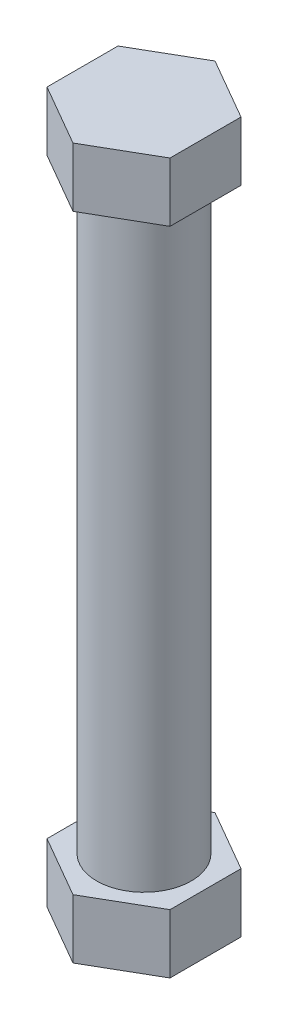
ISO-10303-21;
HEADER;
FILE_DESCRIPTION(('STEP AP214'),'2;1');
FILE_NAME('part.step','',(''),(''),'','','');
FILE_SCHEMA(('AUTOMOTIVE_DESIGN { 1 0 10303 214 1 1 1 1 }'));
ENDSEC;
DATA;
#1=APPLICATION_CONTEXT('core data for automotive mechanical design processes');
#2=APPLICATION_PROTOCOL_DEFINITION('international standard','automotive_design',2000,#1);
#3=PRODUCT_CONTEXT('',#1,'mechanical');
#4=PRODUCT('Part','Part','',(#3));
#5=PRODUCT_RELATED_PRODUCT_CATEGORY('part','',(#4));
#6=PRODUCT_DEFINITION_FORMATION('','',#4);
#7=PRODUCT_DEFINITION_CONTEXT('part definition',#1,'design');
#8=PRODUCT_DEFINITION('design','',#6,#7);
#9=PRODUCT_DEFINITION_SHAPE('','',#8);
#10=(LENGTH_UNIT() NAMED_UNIT(*) SI_UNIT(.MILLI.,.METRE.));
#11=(NAMED_UNIT(*) PLANE_ANGLE_UNIT() SI_UNIT($,.RADIAN.));
#12=(NAMED_UNIT(*) SI_UNIT($,.STERADIAN.) SOLID_ANGLE_UNIT());
#13=UNCERTAINTY_MEASURE_WITH_UNIT(LENGTH_MEASURE(1.E-05),#10,'distance_accuracy_value','');
#14=(GEOMETRIC_REPRESENTATION_CONTEXT(3) GLOBAL_UNCERTAINTY_ASSIGNED_CONTEXT((#13)) GLOBAL_UNIT_ASSIGNED_CONTEXT((#10,
#11,#12)) REPRESENTATION_CONTEXT('',''));
#15=CARTESIAN_POINT('',(0.,0.,0.));
#16=DIRECTION('',(0.,0.,1.));
#17=DIRECTION('',(1.,0.,0.));
#18=AXIS2_PLACEMENT_3D('',#15,#16,#17);
#19=CARTESIAN_POINT('',(0.,127.,0.));
#20=DIRECTION('',(0.,-1.,0.));
#21=DIRECTION('',(0.,0.,-1.));
#22=AXIS2_PLACEMENT_3D('',#19,#20,#21);
#23=CYLINDRICAL_SURFACE('',#22,10.16);
#24=CARTESIAN_POINT('',(0.,127.,0.));
#25=DIRECTION('',(0.,1.,0.));
#26=DIRECTION('',(0.,0.,1.));
#27=AXIS2_PLACEMENT_3D('',#24,#25,#26);
#28=CIRCLE('',#27,10.16);
#29=CARTESIAN_POINT('',(0.,127.,10.16));
#30=VERTEX_POINT('',#29);
#31=EDGE_CURVE('E11',#30,#30,#28,.T.);
#32=ORIENTED_EDGE('',*,*,#31,.F.);
#33=EDGE_LOOP('',(#32));
#34=FACE_BOUND('',#33,.T.);
#35=CARTESIAN_POINT('',(0.,0.,0.));
#36=DIRECTION('',(0.,1.,0.));
#37=DIRECTION('',(0.,0.,1.));
#38=AXIS2_PLACEMENT_3D('',#35,#36,#37);
#39=CIRCLE('',#38,10.16);
#40=CARTESIAN_POINT('',(0.,0.,10.16));
#41=VERTEX_POINT('',#40);
#42=EDGE_CURVE('E36',#41,#41,#39,.T.);
#43=ORIENTED_EDGE('',*,*,#42,.T.);
#44=EDGE_LOOP('',(#43));
#45=FACE_BOUND('',#44,.T.);
#46=ADVANCED_FACE('F33',(#34,#45),#23,.T.);
#47=CARTESIAN_POINT('',(13.1982271536748,139.7,-7.62));
#48=DIRECTION('',(-0.5,0.,0.866025403784439));
#49=DIRECTION('',(0.866025403784439,0.,0.5));
#50=AXIS2_PLACEMENT_3D('',#47,#48,#49);
#51=PLANE('',#50);
#52=DIRECTION('',(-0.866025403784439,0.,-0.5));
#53=VECTOR('',#52,1.);
#54=CARTESIAN_POINT('',(13.1982271536748,127.,-7.62));
#55=LINE('',#54,#53);
#56=CARTESIAN_POINT('',(13.1982271536748,127.,-7.62));
#57=VERTEX_POINT('',#56);
#58=CARTESIAN_POINT('',(0.,127.,-15.24));
#59=VERTEX_POINT('',#58);
#60=EDGE_CURVE('E123',#57,#59,#55,.T.);
#61=ORIENTED_EDGE('',*,*,#60,.T.);
#62=DIRECTION('',(0.,-1.,0.));
#63=VECTOR('',#62,1.);
#64=CARTESIAN_POINT('',(0.,139.7,-15.24));
#65=LINE('',#64,#63);
#66=CARTESIAN_POINT('',(0.,139.7,-15.24));
#67=VERTEX_POINT('',#66);
#68=EDGE_CURVE('E42',#67,#59,#65,.T.);
#69=ORIENTED_EDGE('',*,*,#68,.F.);
#70=DIRECTION('',(-0.866025403784439,0.,-0.5));
#71=VECTOR('',#70,1.);
#72=CARTESIAN_POINT('',(13.1982271536748,139.7,-7.62));
#73=LINE('',#72,#71);
#74=CARTESIAN_POINT('',(13.1982271536748,139.7,-7.62));
#75=VERTEX_POINT('',#74);
#76=EDGE_CURVE('E133',#75,#67,#73,.T.);
#77=ORIENTED_EDGE('',*,*,#76,.F.);
#78=DIRECTION('',(0.,-1.,0.));
#79=VECTOR('',#78,1.);
#80=CARTESIAN_POINT('',(13.1982271536748,139.7,-7.62));
#81=LINE('',#80,#79);
#82=EDGE_CURVE('E119',#75,#57,#81,.T.);
#83=ORIENTED_EDGE('',*,*,#82,.T.);
#84=EDGE_LOOP('',(#61,#69,#77,#83));
#85=FACE_BOUND('',#84,.T.);
#86=ADVANCED_FACE('F145',(#85),#51,.F.);
#87=CARTESIAN_POINT('',(0.,139.7,-15.24));
#88=DIRECTION('',(0.5,0.,0.866025403784439));
#89=DIRECTION('',(0.866025403784439,0.,-0.5));
#90=AXIS2_PLACEMENT_3D('',#87,#88,#89);
#91=PLANE('',#90);
#92=DIRECTION('',(-0.866025403784439,0.,0.5));
#93=VECTOR('',#92,1.);
#94=CARTESIAN_POINT('',(0.,127.,-15.24));
#95=LINE('',#94,#93);
#96=CARTESIAN_POINT('',(-13.1982271536749,127.,-7.62));
#97=VERTEX_POINT('',#96);
#98=EDGE_CURVE('E126',#59,#97,#95,.T.);
#99=ORIENTED_EDGE('',*,*,#98,.T.);
#100=DIRECTION('',(0.,-1.,0.));
#101=VECTOR('',#100,1.);
#102=CARTESIAN_POINT('',(-13.1982271536749,139.7,-7.62));
#103=LINE('',#102,#101);
#104=CARTESIAN_POINT('',(-13.1982271536749,139.7,-7.62));
#105=VERTEX_POINT('',#104);
#106=EDGE_CURVE('E137',#105,#97,#103,.T.);
#107=ORIENTED_EDGE('',*,*,#106,.F.);
#108=DIRECTION('',(-0.866025403784439,0.,0.5));
#109=VECTOR('',#108,1.);
#110=CARTESIAN_POINT('',(0.,139.7,-15.24));
#111=LINE('',#110,#109);
#112=EDGE_CURVE('E89',#67,#105,#111,.T.);
#113=ORIENTED_EDGE('',*,*,#112,.F.);
#114=ORIENTED_EDGE('',*,*,#68,.T.);
#115=EDGE_LOOP('',(#99,#107,#113,#114));
#116=FACE_BOUND('',#115,.T.);
#117=ADVANCED_FACE('F141',(#116),#91,.F.);
#118=CARTESIAN_POINT('',(-13.1982271536749,139.7,-7.62));
#119=DIRECTION('',(1.,0.,0.));
#120=DIRECTION('',(0.,0.,-1.));
#121=AXIS2_PLACEMENT_3D('',#118,#119,#120);
#122=PLANE('',#121);
#123=DIRECTION('',(0.,0.,1.));
#124=VECTOR('',#123,1.);
#125=CARTESIAN_POINT('',(-13.1982271536749,127.,-7.62));
#126=LINE('',#125,#124);
#127=CARTESIAN_POINT('',(-13.1982271536748,127.,7.62));
#128=VERTEX_POINT('',#127);
#129=EDGE_CURVE('E128',#97,#128,#126,.T.);
#130=ORIENTED_EDGE('',*,*,#129,.T.);
#131=DIRECTION('',(0.,-1.,0.));
#132=VECTOR('',#131,1.);
#133=CARTESIAN_POINT('',(-13.1982271536748,139.7,7.62));
#134=LINE('',#133,#132);
#135=CARTESIAN_POINT('',(-13.1982271536748,139.7,7.62));
#136=VERTEX_POINT('',#135);
#137=EDGE_CURVE('E114',#136,#128,#134,.T.);
#138=ORIENTED_EDGE('',*,*,#137,.F.);
#139=DIRECTION('',(0.,0.,1.));
#140=VECTOR('',#139,1.);
#141=CARTESIAN_POINT('',(-13.1982271536749,139.7,-7.62));
#142=LINE('',#141,#140);
#143=EDGE_CURVE('E105',#105,#136,#142,.T.);
#144=ORIENTED_EDGE('',*,*,#143,.F.);
#145=ORIENTED_EDGE('',*,*,#106,.T.);
#146=EDGE_LOOP('',(#130,#138,#144,#145));
#147=FACE_BOUND('',#146,.T.);
#148=ADVANCED_FACE('F150',(#147),#122,.F.);
#149=CARTESIAN_POINT('',(-13.1982271536748,139.7,7.62));
#150=DIRECTION('',(0.5,0.,-0.866025403784439));
#151=DIRECTION('',(-0.866025403784439,0.,-0.5));
#152=AXIS2_PLACEMENT_3D('',#149,#150,#151);
#153=PLANE('',#152);
#154=DIRECTION('',(0.866025403784439,0.,0.5));
#155=VECTOR('',#154,1.);
#156=CARTESIAN_POINT('',(-13.1982271536748,127.,7.62));
#157=LINE('',#156,#155);
#158=CARTESIAN_POINT('',(0.,127.,15.24));
#159=VERTEX_POINT('',#158);
#160=EDGE_CURVE('E113',#128,#159,#157,.T.);
#161=ORIENTED_EDGE('',*,*,#160,.T.);
#162=DIRECTION('',(0.,-1.,0.));
#163=VECTOR('',#162,1.);
#164=CARTESIAN_POINT('',(0.,139.7,15.24));
#165=LINE('',#164,#163);
#166=CARTESIAN_POINT('',(0.,139.7,15.24));
#167=VERTEX_POINT('',#166);
#168=EDGE_CURVE('E110',#167,#159,#165,.T.);
#169=ORIENTED_EDGE('',*,*,#168,.F.);
#170=DIRECTION('',(0.866025403784439,0.,0.5));
#171=VECTOR('',#170,1.);
#172=CARTESIAN_POINT('',(-13.1982271536748,139.7,7.62));
#173=LINE('',#172,#171);
#174=EDGE_CURVE('E99',#136,#167,#173,.T.);
#175=ORIENTED_EDGE('',*,*,#174,.F.);
#176=ORIENTED_EDGE('',*,*,#137,.T.);
#177=EDGE_LOOP('',(#161,#169,#175,#176));
#178=FACE_BOUND('',#177,.T.);
#179=ADVANCED_FACE('F111',(#178),#153,.F.);
#180=CARTESIAN_POINT('',(0.,139.7,15.24));
#181=DIRECTION('',(-0.5,0.,-0.866025403784439));
#182=DIRECTION('',(-0.866025403784439,0.,0.5));
#183=AXIS2_PLACEMENT_3D('',#180,#181,#182);
#184=PLANE('',#183);
#185=DIRECTION('',(0.866025403784438,0.,-0.5));
#186=VECTOR('',#185,1.);
#187=CARTESIAN_POINT('',(0.,127.,15.24));
#188=LINE('',#187,#186);
#189=CARTESIAN_POINT('',(13.1982271536749,127.,7.62));
#190=VERTEX_POINT('',#189);
#191=EDGE_CURVE('E74',#159,#190,#188,.T.);
#192=ORIENTED_EDGE('',*,*,#191,.T.);
#193=DIRECTION('',(0.,-1.,0.));
#194=VECTOR('',#193,1.);
#195=CARTESIAN_POINT('',(13.1982271536749,139.7,7.62));
#196=LINE('',#195,#194);
#197=CARTESIAN_POINT('',(13.1982271536749,139.7,7.62));
#198=VERTEX_POINT('',#197);
#199=EDGE_CURVE('E115',#198,#190,#196,.T.);
#200=ORIENTED_EDGE('',*,*,#199,.F.);
#201=DIRECTION('',(0.866025403784438,0.,-0.5));
#202=VECTOR('',#201,1.);
#203=CARTESIAN_POINT('',(0.,139.7,15.24));
#204=LINE('',#203,#202);
#205=EDGE_CURVE('E103',#167,#198,#204,.T.);
#206=ORIENTED_EDGE('',*,*,#205,.F.);
#207=ORIENTED_EDGE('',*,*,#168,.T.);
#208=EDGE_LOOP('',(#192,#200,#206,#207));
#209=FACE_BOUND('',#208,.T.);
#210=ADVANCED_FACE('F117',(#209),#184,.F.);
#211=CARTESIAN_POINT('',(13.1982271536749,139.7,7.62));
#212=DIRECTION('',(-1.,0.,0.));
#213=DIRECTION('',(0.,0.,1.));
#214=AXIS2_PLACEMENT_3D('',#211,#212,#213);
#215=PLANE('',#214);
#216=DIRECTION('',(0.,0.,-1.));
#217=VECTOR('',#216,1.);
#218=CARTESIAN_POINT('',(13.1982271536749,127.,7.62));
#219=LINE('',#218,#217);
#220=EDGE_CURVE('E80',#190,#57,#219,.T.);
#221=ORIENTED_EDGE('',*,*,#220,.T.);
#222=ORIENTED_EDGE('',*,*,#82,.F.);
#223=DIRECTION('',(0.,0.,-1.));
#224=VECTOR('',#223,1.);
#225=CARTESIAN_POINT('',(13.1982271536749,139.7,7.62));
#226=LINE('',#225,#224);
#227=EDGE_CURVE('E50',#198,#75,#226,.T.);
#228=ORIENTED_EDGE('',*,*,#227,.F.);
#229=ORIENTED_EDGE('',*,*,#199,.T.);
#230=EDGE_LOOP('',(#221,#222,#228,#229));
#231=FACE_BOUND('',#230,.T.);
#232=ADVANCED_FACE('F269',(#231),#215,.F.);
#233=CARTESIAN_POINT('',(0.,139.7,0.));
#234=DIRECTION('',(0.,1.,0.));
#235=DIRECTION('',(0.,0.,1.));
#236=AXIS2_PLACEMENT_3D('',#233,#234,#235);
#237=PLANE('',#236);
#238=ORIENTED_EDGE('',*,*,#76,.T.);
#239=ORIENTED_EDGE('',*,*,#112,.T.);
#240=ORIENTED_EDGE('',*,*,#143,.T.);
#241=ORIENTED_EDGE('',*,*,#174,.T.);
#242=ORIENTED_EDGE('',*,*,#205,.T.);
#243=ORIENTED_EDGE('',*,*,#227,.T.);
#244=EDGE_LOOP('',(#238,#239,#240,#241,#242,#243));
#245=FACE_BOUND('',#244,.T.);
#246=ADVANCED_FACE('F101',(#245),#237,.T.);
#247=CARTESIAN_POINT('',(0.,127.,0.));
#248=DIRECTION('',(0.,1.,0.));
#249=DIRECTION('',(0.,0.,1.));
#250=AXIS2_PLACEMENT_3D('',#247,#248,#249);
#251=PLANE('',#250);
#252=ORIENTED_EDGE('',*,*,#31,.T.);
#253=EDGE_LOOP('',(#252));
#254=FACE_BOUND('',#253,.T.);
#255=ORIENTED_EDGE('',*,*,#60,.F.);
#256=ORIENTED_EDGE('',*,*,#220,.F.);
#257=ORIENTED_EDGE('',*,*,#191,.F.);
#258=ORIENTED_EDGE('',*,*,#160,.F.);
#259=ORIENTED_EDGE('',*,*,#129,.F.);
#260=ORIENTED_EDGE('',*,*,#98,.F.);
#261=EDGE_LOOP('',(#255,#256,#257,#258,#259,#260));
#262=FACE_BOUND('',#261,.T.);
#263=ADVANCED_FACE('F147',(#254,#262),#251,.F.);
#264=CARTESIAN_POINT('',(0.,-12.7,15.24));
#265=DIRECTION('',(0.5,0.,-0.866025403784438));
#266=DIRECTION('',(-0.866025403784439,0.,-0.5));
#267=AXIS2_PLACEMENT_3D('',#264,#265,#266);
#268=PLANE('',#267);
#269=DIRECTION('',(-0.866025403784438,0.,-0.5));
#270=VECTOR('',#269,1.);
#271=CARTESIAN_POINT('',(0.,0.,15.24));
#272=LINE('',#271,#270);
#273=CARTESIAN_POINT('',(0.,0.,15.24));
#274=VERTEX_POINT('',#273);
#275=CARTESIAN_POINT('',(-13.1982271536748,0.,7.62));
#276=VERTEX_POINT('',#275);
#277=EDGE_CURVE('E189',#274,#276,#272,.T.);
#278=ORIENTED_EDGE('',*,*,#277,.T.);
#279=DIRECTION('',(0.,1.,0.));
#280=VECTOR('',#279,1.);
#281=CARTESIAN_POINT('',(-13.1982271536748,-12.7,7.62));
#282=LINE('',#281,#280);
#283=CARTESIAN_POINT('',(-13.1982271536748,-12.7,7.62));
#284=VERTEX_POINT('',#283);
#285=EDGE_CURVE('E154',#284,#276,#282,.T.);
#286=ORIENTED_EDGE('',*,*,#285,.F.);
#287=DIRECTION('',(-0.866025403784438,0.,-0.5));
#288=VECTOR('',#287,1.);
#289=CARTESIAN_POINT('',(0.,-12.7,15.24));
#290=LINE('',#289,#288);
#291=CARTESIAN_POINT('',(0.,-12.7,15.24));
#292=VERTEX_POINT('',#291);
#293=EDGE_CURVE('E176',#292,#284,#290,.T.);
#294=ORIENTED_EDGE('',*,*,#293,.F.);
#295=DIRECTION('',(0.,1.,0.));
#296=VECTOR('',#295,1.);
#297=CARTESIAN_POINT('',(0.,-12.7,15.24));
#298=LINE('',#297,#296);
#299=EDGE_CURVE('E169',#292,#274,#298,.T.);
#300=ORIENTED_EDGE('',*,*,#299,.T.);
#301=EDGE_LOOP('',(#278,#286,#294,#300));
#302=FACE_BOUND('',#301,.T.);
#303=ADVANCED_FACE('F219',(#302),#268,.F.);
#304=CARTESIAN_POINT('',(-13.1982271536748,-12.7,7.62));
#305=DIRECTION('',(1.,0.,0.));
#306=DIRECTION('',(0.,0.,-1.));
#307=AXIS2_PLACEMENT_3D('',#304,#305,#306);
#308=PLANE('',#307);
#309=DIRECTION('',(0.,0.,-1.));
#310=VECTOR('',#309,1.);
#311=CARTESIAN_POINT('',(-13.1982271536748,0.,7.62));
#312=LINE('',#311,#310);
#313=CARTESIAN_POINT('',(-13.1982271536748,0.,-7.62));
#314=VERTEX_POINT('',#313);
#315=EDGE_CURVE('E186',#276,#314,#312,.T.);
#316=ORIENTED_EDGE('',*,*,#315,.T.);
#317=DIRECTION('',(0.,1.,0.));
#318=VECTOR('',#317,1.);
#319=CARTESIAN_POINT('',(-13.1982271536748,-12.7,-7.62));
#320=LINE('',#319,#318);
#321=CARTESIAN_POINT('',(-13.1982271536748,-12.7,-7.62));
#322=VERTEX_POINT('',#321);
#323=EDGE_CURVE('E157',#322,#314,#320,.T.);
#324=ORIENTED_EDGE('',*,*,#323,.F.);
#325=DIRECTION('',(0.,0.,-1.));
#326=VECTOR('',#325,1.);
#327=CARTESIAN_POINT('',(-13.1982271536748,-12.7,7.62));
#328=LINE('',#327,#326);
#329=EDGE_CURVE('E203',#284,#322,#328,.T.);
#330=ORIENTED_EDGE('',*,*,#329,.F.);
#331=ORIENTED_EDGE('',*,*,#285,.T.);
#332=EDGE_LOOP('',(#316,#324,#330,#331));
#333=FACE_BOUND('',#332,.T.);
#334=ADVANCED_FACE('F223',(#333),#308,.F.);
#335=CARTESIAN_POINT('',(-13.1982271536748,-12.7,-7.62));
#336=DIRECTION('',(0.5,0.,0.866025403784439));
#337=DIRECTION('',(0.866025403784439,0.,-0.5));
#338=AXIS2_PLACEMENT_3D('',#335,#336,#337);
#339=PLANE('',#338);
#340=DIRECTION('',(0.866025403784439,0.,-0.5));
#341=VECTOR('',#340,1.);
#342=CARTESIAN_POINT('',(-13.1982271536748,0.,-7.62));
#343=LINE('',#342,#341);
#344=CARTESIAN_POINT('',(0.,0.,-15.24));
#345=VERTEX_POINT('',#344);
#346=EDGE_CURVE('E183',#314,#345,#343,.T.);
#347=ORIENTED_EDGE('',*,*,#346,.T.);
#348=DIRECTION('',(0.,1.,0.));
#349=VECTOR('',#348,1.);
#350=CARTESIAN_POINT('',(0.,-12.7,-15.24));
#351=LINE('',#350,#349);
#352=CARTESIAN_POINT('',(0.,-12.7,-15.24));
#353=VERTEX_POINT('',#352);
#354=EDGE_CURVE('E160',#353,#345,#351,.T.);
#355=ORIENTED_EDGE('',*,*,#354,.F.);
#356=DIRECTION('',(0.866025403784439,0.,-0.5));
#357=VECTOR('',#356,1.);
#358=CARTESIAN_POINT('',(-13.1982271536748,-12.7,-7.62));
#359=LINE('',#358,#357);
#360=EDGE_CURVE('E200',#322,#353,#359,.T.);
#361=ORIENTED_EDGE('',*,*,#360,.F.);
#362=ORIENTED_EDGE('',*,*,#323,.T.);
#363=EDGE_LOOP('',(#347,#355,#361,#362));
#364=FACE_BOUND('',#363,.T.);
#365=ADVANCED_FACE('F324',(#364),#339,.F.);
#366=CARTESIAN_POINT('',(0.,-12.7,-15.24));
#367=DIRECTION('',(-0.5,0.,0.866025403784439));
#368=DIRECTION('',(0.866025403784439,0.,0.5));
#369=AXIS2_PLACEMENT_3D('',#366,#367,#368);
#370=PLANE('',#369);
#371=DIRECTION('',(0.866025403784439,0.,0.5));
#372=VECTOR('',#371,1.);
#373=CARTESIAN_POINT('',(0.,0.,-15.24));
#374=LINE('',#373,#372);
#375=CARTESIAN_POINT('',(13.1982271536748,0.,-7.62));
#376=VERTEX_POINT('',#375);
#377=EDGE_CURVE('E180',#345,#376,#374,.T.);
#378=ORIENTED_EDGE('',*,*,#377,.T.);
#379=DIRECTION('',(0.,1.,0.));
#380=VECTOR('',#379,1.);
#381=CARTESIAN_POINT('',(13.1982271536748,-12.7,-7.62));
#382=LINE('',#381,#380);
#383=CARTESIAN_POINT('',(13.1982271536748,-12.7,-7.62));
#384=VERTEX_POINT('',#383);
#385=EDGE_CURVE('E163',#384,#376,#382,.T.);
#386=ORIENTED_EDGE('',*,*,#385,.F.);
#387=DIRECTION('',(0.866025403784439,0.,0.5));
#388=VECTOR('',#387,1.);
#389=CARTESIAN_POINT('',(0.,-12.7,-15.24));
#390=LINE('',#389,#388);
#391=EDGE_CURVE('E197',#353,#384,#390,.T.);
#392=ORIENTED_EDGE('',*,*,#391,.F.);
#393=ORIENTED_EDGE('',*,*,#354,.T.);
#394=EDGE_LOOP('',(#378,#386,#392,#393));
#395=FACE_BOUND('',#394,.T.);
#396=ADVANCED_FACE('F333',(#395),#370,.F.);
#397=CARTESIAN_POINT('',(13.1982271536748,-12.7,-7.62));
#398=DIRECTION('',(-1.,0.,0.));
#399=DIRECTION('',(0.,0.,1.));
#400=AXIS2_PLACEMENT_3D('',#397,#398,#399);
#401=PLANE('',#400);
#402=DIRECTION('',(0.,0.,1.));
#403=VECTOR('',#402,1.);
#404=CARTESIAN_POINT('',(13.1982271536748,0.,-7.62));
#405=LINE('',#404,#403);
#406=CARTESIAN_POINT('',(13.1982271536748,0.,7.61999999999998));
#407=VERTEX_POINT('',#406);
#408=EDGE_CURVE('E177',#376,#407,#405,.T.);
#409=ORIENTED_EDGE('',*,*,#408,.T.);
#410=DIRECTION('',(0.,1.,0.));
#411=VECTOR('',#410,1.);
#412=CARTESIAN_POINT('',(13.1982271536748,-12.7,7.61999999999998));
#413=LINE('',#412,#411);
#414=CARTESIAN_POINT('',(13.1982271536748,-12.7,7.61999999999998));
#415=VERTEX_POINT('',#414);
#416=EDGE_CURVE('E166',#415,#407,#413,.T.);
#417=ORIENTED_EDGE('',*,*,#416,.F.);
#418=DIRECTION('',(0.,0.,1.));
#419=VECTOR('',#418,1.);
#420=CARTESIAN_POINT('',(13.1982271536748,-12.7,-7.62));
#421=LINE('',#420,#419);
#422=EDGE_CURVE('E194',#384,#415,#421,.T.);
#423=ORIENTED_EDGE('',*,*,#422,.F.);
#424=ORIENTED_EDGE('',*,*,#385,.T.);
#425=EDGE_LOOP('',(#409,#417,#423,#424));
#426=FACE_BOUND('',#425,.T.);
#427=ADVANCED_FACE('F343',(#426),#401,.F.);
#428=CARTESIAN_POINT('',(13.1982271536748,-12.7,7.61999999999998));
#429=DIRECTION('',(-0.5,0.,-0.866025403784439));
#430=DIRECTION('',(-0.866025403784439,0.,0.5));
#431=AXIS2_PLACEMENT_3D('',#428,#429,#430);
#432=PLANE('',#431);
#433=DIRECTION('',(-0.866025403784439,0.,0.5));
#434=VECTOR('',#433,1.);
#435=CARTESIAN_POINT('',(13.1982271536748,0.,7.61999999999998));
#436=LINE('',#435,#434);
#437=EDGE_CURVE('E173',#407,#274,#436,.T.);
#438=ORIENTED_EDGE('',*,*,#437,.T.);
#439=ORIENTED_EDGE('',*,*,#299,.F.);
#440=DIRECTION('',(-0.866025403784439,0.,0.5));
#441=VECTOR('',#440,1.);
#442=CARTESIAN_POINT('',(13.1982271536748,-12.7,7.61999999999998));
#443=LINE('',#442,#441);
#444=EDGE_CURVE('E172',#415,#292,#443,.T.);
#445=ORIENTED_EDGE('',*,*,#444,.F.);
#446=ORIENTED_EDGE('',*,*,#416,.T.);
#447=EDGE_LOOP('',(#438,#439,#445,#446));
#448=FACE_BOUND('',#447,.T.);
#449=ADVANCED_FACE('F242',(#448),#432,.F.);
#450=CARTESIAN_POINT('',(0.,-12.7,0.));
#451=DIRECTION('',(0.,-1.,0.));
#452=DIRECTION('',(0.,0.,-1.));
#453=AXIS2_PLACEMENT_3D('',#450,#451,#452);
#454=PLANE('',#453);
#455=ORIENTED_EDGE('',*,*,#293,.T.);
#456=ORIENTED_EDGE('',*,*,#329,.T.);
#457=ORIENTED_EDGE('',*,*,#360,.T.);
#458=ORIENTED_EDGE('',*,*,#391,.T.);
#459=ORIENTED_EDGE('',*,*,#422,.T.);
#460=ORIENTED_EDGE('',*,*,#444,.T.);
#461=EDGE_LOOP('',(#455,#456,#457,#458,#459,#460));
#462=FACE_BOUND('',#461,.T.);
#463=ADVANCED_FACE('F211',(#462),#454,.T.);
#464=CARTESIAN_POINT('',(0.,0.,0.));
#465=DIRECTION('',(0.,-1.,0.));
#466=DIRECTION('',(0.,0.,-1.));
#467=AXIS2_PLACEMENT_3D('',#464,#465,#466);
#468=PLANE('',#467);
#469=ORIENTED_EDGE('',*,*,#42,.F.);
#470=EDGE_LOOP('',(#469));
#471=FACE_BOUND('',#470,.T.);
#472=ORIENTED_EDGE('',*,*,#277,.F.);
#473=ORIENTED_EDGE('',*,*,#437,.F.);
#474=ORIENTED_EDGE('',*,*,#408,.F.);
#475=ORIENTED_EDGE('',*,*,#377,.F.);
#476=ORIENTED_EDGE('',*,*,#346,.F.);
#477=ORIENTED_EDGE('',*,*,#315,.F.);
#478=EDGE_LOOP('',(#472,#473,#474,#475,#476,#477));
#479=FACE_BOUND('',#478,.T.);
#480=ADVANCED_FACE('F243',(#471,#479),#468,.F.);
#481=CLOSED_SHELL('',(#46,#86,#117,#148,#179,#210,#232,#246,#263,#303,#334,#365,#396,#427,#449,
#463,#480));
#482=MANIFOLD_SOLID_BREP('B2',#481);
#483=ADVANCED_BREP_SHAPE_REPRESENTATION('',(#18,#482),#14);
#484=SHAPE_DEFINITION_REPRESENTATION(#9,#483);
ENDSEC;
END-ISO-10303-21;
